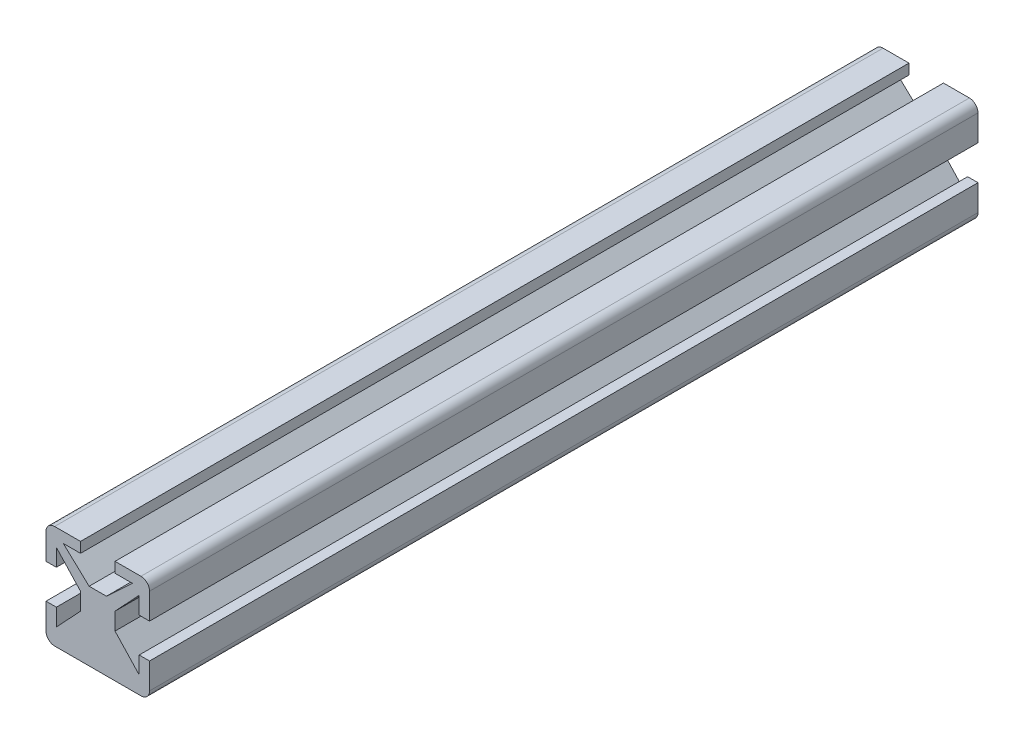
ISO-10303-21;
HEADER;
FILE_DESCRIPTION(('STEP AP214'),'2;1');
FILE_NAME('part.step','',(''),(''),'','','');
FILE_SCHEMA(('AUTOMOTIVE_DESIGN { 1 0 10303 214 1 1 1 1 }'));
ENDSEC;
DATA;
#1=APPLICATION_CONTEXT('core data for automotive mechanical design processes');
#2=APPLICATION_PROTOCOL_DEFINITION('international standard','automotive_design',2000,#1);
#3=PRODUCT_CONTEXT('',#1,'mechanical');
#4=PRODUCT('Part','Part','',(#3));
#5=PRODUCT_RELATED_PRODUCT_CATEGORY('part','',(#4));
#6=PRODUCT_DEFINITION_FORMATION('','',#4);
#7=PRODUCT_DEFINITION_CONTEXT('part definition',#1,'design');
#8=PRODUCT_DEFINITION('design','',#6,#7);
#9=PRODUCT_DEFINITION_SHAPE('','',#8);
#10=(LENGTH_UNIT() NAMED_UNIT(*) SI_UNIT(.MILLI.,.METRE.));
#11=(NAMED_UNIT(*) PLANE_ANGLE_UNIT() SI_UNIT($,.RADIAN.));
#12=(NAMED_UNIT(*) SI_UNIT($,.STERADIAN.) SOLID_ANGLE_UNIT());
#13=UNCERTAINTY_MEASURE_WITH_UNIT(LENGTH_MEASURE(1.E-05),#10,'distance_accuracy_value','');
#14=(GEOMETRIC_REPRESENTATION_CONTEXT(3) GLOBAL_UNCERTAINTY_ASSIGNED_CONTEXT((#13)) GLOBAL_UNIT_ASSIGNED_CONTEXT((#10,
#11,#12)) REPRESENTATION_CONTEXT('',''));
#15=CARTESIAN_POINT('',(0.,0.,0.));
#16=DIRECTION('',(0.,0.,1.));
#17=DIRECTION('',(1.,0.,0.));
#18=AXIS2_PLACEMENT_3D('',#15,#16,#17);
#19=CARTESIAN_POINT('',(-6.,5.,48.));
#20=DIRECTION('',(1.,0.,0.));
#21=DIRECTION('',(0.,1.,0.));
#22=AXIS2_PLACEMENT_3D('',#19,#20,#21);
#23=PLANE('',#22);
#24=DIRECTION('',(0.,-1.,0.));
#25=VECTOR('',#24,1.);
#26=CARTESIAN_POINT('',(-6.,5.,-48.));
#27=LINE('',#26,#25);
#28=CARTESIAN_POINT('',(-6.,5.,-48.));
#29=VERTEX_POINT('',#28);
#30=CARTESIAN_POINT('',(-6.,2.,-48.));
#31=VERTEX_POINT('',#30);
#32=EDGE_CURVE('E265',#29,#31,#27,.T.);
#33=ORIENTED_EDGE('',*,*,#32,.T.);
#34=DIRECTION('',(0.,0.,1.));
#35=VECTOR('',#34,1.);
#36=CARTESIAN_POINT('',(-6.,2.,-48.));
#37=LINE('',#36,#35);
#38=CARTESIAN_POINT('',(-6.,2.,48.));
#39=VERTEX_POINT('',#38);
#40=EDGE_CURVE('E338',#31,#39,#37,.T.);
#41=ORIENTED_EDGE('',*,*,#40,.T.);
#42=DIRECTION('',(0.,-1.,0.));
#43=VECTOR('',#42,1.);
#44=CARTESIAN_POINT('',(-6.,5.,48.));
#45=LINE('',#44,#43);
#46=CARTESIAN_POINT('',(-6.,5.,48.));
#47=VERTEX_POINT('',#46);
#48=EDGE_CURVE('E277',#47,#39,#45,.T.);
#49=ORIENTED_EDGE('',*,*,#48,.F.);
#50=DIRECTION('',(0.,0.,-1.));
#51=VECTOR('',#50,1.);
#52=CARTESIAN_POINT('',(-6.,5.,48.));
#53=LINE('',#52,#51);
#54=EDGE_CURVE('E276',#47,#29,#53,.T.);
#55=ORIENTED_EDGE('',*,*,#54,.T.);
#56=EDGE_LOOP('',(#33,#41,#49,#55));
#57=FACE_BOUND('',#56,.T.);
#58=ADVANCED_FACE('F32',(#57),#23,.F.);
#59=CARTESIAN_POINT('',(-5.,6.,48.));
#60=DIRECTION('',(0.,-1.,0.));
#61=DIRECTION('',(0.,0.,-1.));
#62=AXIS2_PLACEMENT_3D('',#59,#60,#61);
#63=PLANE('',#62);
#64=DIRECTION('',(-1.,0.,0.));
#65=VECTOR('',#64,1.);
#66=CARTESIAN_POINT('',(-5.,6.,-48.));
#67=LINE('',#66,#65);
#68=CARTESIAN_POINT('',(5.,6.,-48.));
#69=VERTEX_POINT('',#68);
#70=CARTESIAN_POINT('',(1.99999999999998,6.00000000000001,-48.));
#71=VERTEX_POINT('',#70);
#72=EDGE_CURVE('E270',#69,#71,#67,.T.);
#73=ORIENTED_EDGE('',*,*,#72,.T.);
#74=DIRECTION('',(0.,0.,1.));
#75=VECTOR('',#74,1.);
#76=CARTESIAN_POINT('',(1.99999999999998,6.00000000000001,-48.));
#77=LINE('',#76,#75);
#78=CARTESIAN_POINT('',(1.99999999999998,6.00000000000001,48.));
#79=VERTEX_POINT('',#78);
#80=EDGE_CURVE('E418',#71,#79,#77,.T.);
#81=ORIENTED_EDGE('',*,*,#80,.T.);
#82=DIRECTION('',(-1.,0.,0.));
#83=VECTOR('',#82,1.);
#84=CARTESIAN_POINT('',(-5.,6.,48.));
#85=LINE('',#84,#83);
#86=CARTESIAN_POINT('',(5.,6.,48.));
#87=VERTEX_POINT('',#86);
#88=EDGE_CURVE('E382',#87,#79,#85,.T.);
#89=ORIENTED_EDGE('',*,*,#88,.F.);
#90=DIRECTION('',(0.,0.,-1.));
#91=VECTOR('',#90,1.);
#92=CARTESIAN_POINT('',(5.,6.,48.));
#93=LINE('',#92,#91);
#94=EDGE_CURVE('E283',#87,#69,#93,.T.);
#95=ORIENTED_EDGE('',*,*,#94,.T.);
#96=EDGE_LOOP('',(#73,#81,#89,#95));
#97=FACE_BOUND('',#96,.T.);
#98=ADVANCED_FACE('F477',(#97),#63,.F.);
#99=CARTESIAN_POINT('',(6.,5.,48.));
#100=DIRECTION('',(-1.,0.,0.));
#101=DIRECTION('',(0.,0.,1.));
#102=AXIS2_PLACEMENT_3D('',#99,#100,#101);
#103=PLANE('',#102);
#104=DIRECTION('',(0.,1.,0.));
#105=VECTOR('',#104,1.);
#106=CARTESIAN_POINT('',(6.,5.,-48.));
#107=LINE('',#106,#105);
#108=CARTESIAN_POINT('',(6.,-5.,-48.));
#109=VERTEX_POINT('',#108);
#110=CARTESIAN_POINT('',(6.,-2.,-48.));
#111=VERTEX_POINT('',#110);
#112=EDGE_CURVE('E305',#109,#111,#107,.T.);
#113=ORIENTED_EDGE('',*,*,#112,.T.);
#114=DIRECTION('',(0.,0.,1.));
#115=VECTOR('',#114,1.);
#116=CARTESIAN_POINT('',(6.,-2.,-48.));
#117=LINE('',#116,#115);
#118=CARTESIAN_POINT('',(6.,-2.,48.));
#119=VERTEX_POINT('',#118);
#120=EDGE_CURVE('E345',#111,#119,#117,.T.);
#121=ORIENTED_EDGE('',*,*,#120,.T.);
#122=DIRECTION('',(0.,1.,0.));
#123=VECTOR('',#122,1.);
#124=CARTESIAN_POINT('',(6.,5.,48.));
#125=LINE('',#124,#123);
#126=CARTESIAN_POINT('',(6.,-5.,48.));
#127=VERTEX_POINT('',#126);
#128=EDGE_CURVE('E378',#127,#119,#125,.T.);
#129=ORIENTED_EDGE('',*,*,#128,.F.);
#130=DIRECTION('',(0.,0.,-1.));
#131=VECTOR('',#130,1.);
#132=CARTESIAN_POINT('',(6.,-5.,48.));
#133=LINE('',#132,#131);
#134=EDGE_CURVE('E289',#127,#109,#133,.T.);
#135=ORIENTED_EDGE('',*,*,#134,.T.);
#136=EDGE_LOOP('',(#113,#121,#129,#135));
#137=FACE_BOUND('',#136,.T.);
#138=ADVANCED_FACE('F475',(#137),#103,.F.);
#139=CARTESIAN_POINT('',(-5.,-5.,48.));
#140=DIRECTION('',(0.,0.,-1.));
#141=DIRECTION('',(-1.,0.,0.));
#142=AXIS2_PLACEMENT_3D('',#139,#140,#141);
#143=CYLINDRICAL_SURFACE('',#142,1.);
#144=CARTESIAN_POINT('',(-5.,-5.,-48.));
#145=DIRECTION('',(0.,0.,1.));
#146=DIRECTION('',(-1.,0.,0.));
#147=AXIS2_PLACEMENT_3D('',#144,#145,#146);
#148=CIRCLE('',#147,1.);
#149=CARTESIAN_POINT('',(-6.,-5.,-48.));
#150=VERTEX_POINT('',#149);
#151=CARTESIAN_POINT('',(-5.,-6.,-48.));
#152=VERTEX_POINT('',#151);
#153=EDGE_CURVE('E264',#150,#152,#148,.T.);
#154=ORIENTED_EDGE('',*,*,#153,.T.);
#155=DIRECTION('',(0.,0.,-1.));
#156=VECTOR('',#155,1.);
#157=CARTESIAN_POINT('',(-5.,-6.,48.));
#158=LINE('',#157,#156);
#159=CARTESIAN_POINT('',(-5.,-6.,48.));
#160=VERTEX_POINT('',#159);
#161=EDGE_CURVE('E11',#160,#152,#158,.T.);
#162=ORIENTED_EDGE('',*,*,#161,.F.);
#163=CARTESIAN_POINT('',(-5.,-5.,48.));
#164=DIRECTION('',(0.,0.,1.));
#165=DIRECTION('',(-1.,0.,0.));
#166=AXIS2_PLACEMENT_3D('',#163,#164,#165);
#167=CIRCLE('',#166,1.);
#168=CARTESIAN_POINT('',(-6.,-5.,48.));
#169=VERTEX_POINT('',#168);
#170=EDGE_CURVE('E269',#169,#160,#167,.T.);
#171=ORIENTED_EDGE('',*,*,#170,.F.);
#172=DIRECTION('',(0.,0.,-1.));
#173=VECTOR('',#172,1.);
#174=CARTESIAN_POINT('',(-6.,-5.,48.));
#175=LINE('',#174,#173);
#176=EDGE_CURVE('E274',#169,#150,#175,.T.);
#177=ORIENTED_EDGE('',*,*,#176,.T.);
#178=EDGE_LOOP('',(#154,#162,#171,#177));
#179=FACE_BOUND('',#178,.T.);
#180=ADVANCED_FACE('F34',(#179),#143,.T.);
#181=CARTESIAN_POINT('',(-5.,-6.,48.));
#182=DIRECTION('',(0.,1.,0.));
#183=DIRECTION('',(-1.,0.,0.));
#184=AXIS2_PLACEMENT_3D('',#181,#182,#183);
#185=PLANE('',#184);
#186=DIRECTION('',(1.,0.,0.));
#187=VECTOR('',#186,1.);
#188=CARTESIAN_POINT('',(-5.,-6.,-48.));
#189=LINE('',#188,#187);
#190=CARTESIAN_POINT('',(5.,-6.,-48.));
#191=VERTEX_POINT('',#190);
#192=EDGE_CURVE('E302',#152,#191,#189,.T.);
#193=ORIENTED_EDGE('',*,*,#192,.T.);
#194=DIRECTION('',(0.,0.,-1.));
#195=VECTOR('',#194,1.);
#196=CARTESIAN_POINT('',(5.,-6.,48.));
#197=LINE('',#196,#195);
#198=CARTESIAN_POINT('',(5.,-6.,48.));
#199=VERTEX_POINT('',#198);
#200=EDGE_CURVE('E40',#199,#191,#197,.T.);
#201=ORIENTED_EDGE('',*,*,#200,.F.);
#202=DIRECTION('',(1.,0.,0.));
#203=VECTOR('',#202,1.);
#204=CARTESIAN_POINT('',(-5.,-6.,48.));
#205=LINE('',#204,#203);
#206=EDGE_CURVE('E374',#160,#199,#205,.T.);
#207=ORIENTED_EDGE('',*,*,#206,.F.);
#208=ORIENTED_EDGE('',*,*,#161,.T.);
#209=EDGE_LOOP('',(#193,#201,#207,#208));
#210=FACE_BOUND('',#209,.T.);
#211=ADVANCED_FACE('F484',(#210),#185,.F.);
#212=CARTESIAN_POINT('',(5.,-5.,48.));
#213=DIRECTION('',(0.,0.,-1.));
#214=DIRECTION('',(-1.,0.,0.));
#215=AXIS2_PLACEMENT_3D('',#212,#213,#214);
#216=CYLINDRICAL_SURFACE('',#215,1.);
#217=CARTESIAN_POINT('',(5.,-5.,-48.));
#218=DIRECTION('',(0.,0.,1.));
#219=DIRECTION('',(-1.,0.,0.));
#220=AXIS2_PLACEMENT_3D('',#217,#218,#219);
#221=CIRCLE('',#220,1.);
#222=EDGE_CURVE('E298',#191,#109,#221,.T.);
#223=ORIENTED_EDGE('',*,*,#222,.T.);
#224=ORIENTED_EDGE('',*,*,#134,.F.);
#225=CARTESIAN_POINT('',(5.,-5.,48.));
#226=DIRECTION('',(0.,0.,1.));
#227=DIRECTION('',(-1.,0.,0.));
#228=AXIS2_PLACEMENT_3D('',#225,#226,#227);
#229=CIRCLE('',#228,1.);
#230=EDGE_CURVE('E299',#199,#127,#229,.T.);
#231=ORIENTED_EDGE('',*,*,#230,.F.);
#232=ORIENTED_EDGE('',*,*,#200,.T.);
#233=EDGE_LOOP('',(#223,#224,#231,#232));
#234=FACE_BOUND('',#233,.T.);
#235=ADVANCED_FACE('F296',(#234),#216,.T.);
#236=CARTESIAN_POINT('',(6.,2.,48.));
#237=VERTEX_POINT('',#236);
#238=CARTESIAN_POINT('',(6.,5.,48.));
#239=VERTEX_POINT('',#238);
#240=EDGE_CURVE('E377',#237,#239,#125,.T.);
#241=ORIENTED_EDGE('',*,*,#240,.F.);
#242=DIRECTION('',(0.,0.,1.));
#243=VECTOR('',#242,1.);
#244=CARTESIAN_POINT('',(6.,2.,-48.));
#245=LINE('',#244,#243);
#246=CARTESIAN_POINT('',(6.,2.,-48.));
#247=VERTEX_POINT('',#246);
#248=EDGE_CURVE('E369',#247,#237,#245,.T.);
#249=ORIENTED_EDGE('',*,*,#248,.F.);
#250=CARTESIAN_POINT('',(6.,5.,-48.));
#251=VERTEX_POINT('',#250);
#252=EDGE_CURVE('E306',#247,#251,#107,.T.);
#253=ORIENTED_EDGE('',*,*,#252,.T.);
#254=DIRECTION('',(0.,0.,-1.));
#255=VECTOR('',#254,1.);
#256=CARTESIAN_POINT('',(6.,5.,48.));
#257=LINE('',#256,#255);
#258=EDGE_CURVE('E286',#239,#251,#257,.T.);
#259=ORIENTED_EDGE('',*,*,#258,.F.);
#260=EDGE_LOOP('',(#241,#249,#253,#259));
#261=FACE_BOUND('',#260,.T.);
#262=ADVANCED_FACE('F479',(#261),#103,.F.);
#263=CARTESIAN_POINT('',(5.,5.,48.));
#264=DIRECTION('',(0.,0.,-1.));
#265=DIRECTION('',(-1.,0.,0.));
#266=AXIS2_PLACEMENT_3D('',#263,#264,#265);
#267=CYLINDRICAL_SURFACE('',#266,1.);
#268=CARTESIAN_POINT('',(5.,5.,-48.));
#269=DIRECTION('',(0.,0.,1.));
#270=DIRECTION('',(-1.,0.,0.));
#271=AXIS2_PLACEMENT_3D('',#268,#269,#270);
#272=CIRCLE('',#271,1.);
#273=EDGE_CURVE('E312',#251,#69,#272,.T.);
#274=ORIENTED_EDGE('',*,*,#273,.T.);
#275=ORIENTED_EDGE('',*,*,#94,.F.);
#276=CARTESIAN_POINT('',(5.,5.,48.));
#277=DIRECTION('',(0.,0.,1.));
#278=DIRECTION('',(-1.,0.,0.));
#279=AXIS2_PLACEMENT_3D('',#276,#277,#278);
#280=CIRCLE('',#279,1.);
#281=EDGE_CURVE('E380',#239,#87,#280,.T.);
#282=ORIENTED_EDGE('',*,*,#281,.F.);
#283=ORIENTED_EDGE('',*,*,#258,.T.);
#284=EDGE_LOOP('',(#274,#275,#282,#283));
#285=FACE_BOUND('',#284,.T.);
#286=ADVANCED_FACE('F489',(#285),#267,.T.);
#287=CARTESIAN_POINT('',(-2.00000000000002,6.,48.));
#288=VERTEX_POINT('',#287);
#289=CARTESIAN_POINT('',(-5.,6.,48.));
#290=VERTEX_POINT('',#289);
#291=EDGE_CURVE('E381',#288,#290,#85,.T.);
#292=ORIENTED_EDGE('',*,*,#291,.F.);
#293=DIRECTION('',(0.,0.,1.));
#294=VECTOR('',#293,1.);
#295=CARTESIAN_POINT('',(-2.00000000000002,6.,-48.));
#296=LINE('',#295,#294);
#297=CARTESIAN_POINT('',(-2.00000000000002,6.,-48.));
#298=VERTEX_POINT('',#297);
#299=EDGE_CURVE('E325',#298,#288,#296,.T.);
#300=ORIENTED_EDGE('',*,*,#299,.F.);
#301=CARTESIAN_POINT('',(-5.,6.,-48.));
#302=VERTEX_POINT('',#301);
#303=EDGE_CURVE('E313',#298,#302,#67,.T.);
#304=ORIENTED_EDGE('',*,*,#303,.T.);
#305=DIRECTION('',(0.,0.,-1.));
#306=VECTOR('',#305,1.);
#307=CARTESIAN_POINT('',(-5.,6.,48.));
#308=LINE('',#307,#306);
#309=EDGE_CURVE('E280',#290,#302,#308,.T.);
#310=ORIENTED_EDGE('',*,*,#309,.F.);
#311=EDGE_LOOP('',(#292,#300,#304,#310));
#312=FACE_BOUND('',#311,.T.);
#313=ADVANCED_FACE('F323',(#312),#63,.F.);
#314=CARTESIAN_POINT('',(-5.,5.,48.));
#315=DIRECTION('',(0.,0.,-1.));
#316=DIRECTION('',(-1.,0.,0.));
#317=AXIS2_PLACEMENT_3D('',#314,#315,#316);
#318=CYLINDRICAL_SURFACE('',#317,1.);
#319=CARTESIAN_POINT('',(-5.,5.,-48.));
#320=DIRECTION('',(0.,0.,1.));
#321=DIRECTION('',(1.,0.,0.));
#322=AXIS2_PLACEMENT_3D('',#319,#320,#321);
#323=CIRCLE('',#322,1.);
#324=EDGE_CURVE('E266',#302,#29,#323,.T.);
#325=ORIENTED_EDGE('',*,*,#324,.T.);
#326=ORIENTED_EDGE('',*,*,#54,.F.);
#327=CARTESIAN_POINT('',(-5.,5.,48.));
#328=DIRECTION('',(0.,0.,1.));
#329=DIRECTION('',(1.,0.,0.));
#330=AXIS2_PLACEMENT_3D('',#327,#328,#329);
#331=CIRCLE('',#330,1.);
#332=EDGE_CURVE('E331',#290,#47,#331,.T.);
#333=ORIENTED_EDGE('',*,*,#332,.F.);
#334=ORIENTED_EDGE('',*,*,#309,.T.);
#335=EDGE_LOOP('',(#325,#326,#333,#334));
#336=FACE_BOUND('',#335,.T.);
#337=ADVANCED_FACE('F329',(#336),#318,.T.);
#338=CARTESIAN_POINT('',(-6.,-2.,48.));
#339=VERTEX_POINT('',#338);
#340=EDGE_CURVE('E257',#339,#169,#45,.T.);
#341=ORIENTED_EDGE('',*,*,#340,.F.);
#342=DIRECTION('',(0.,0.,1.));
#343=VECTOR('',#342,1.);
#344=CARTESIAN_POINT('',(-6.,-2.,-48.));
#345=LINE('',#344,#343);
#346=CARTESIAN_POINT('',(-6.,-2.,-48.));
#347=VERTEX_POINT('',#346);
#348=EDGE_CURVE('E244',#347,#339,#345,.T.);
#349=ORIENTED_EDGE('',*,*,#348,.F.);
#350=EDGE_CURVE('E255',#347,#150,#27,.T.);
#351=ORIENTED_EDGE('',*,*,#350,.T.);
#352=ORIENTED_EDGE('',*,*,#176,.F.);
#353=EDGE_LOOP('',(#341,#349,#351,#352));
#354=FACE_BOUND('',#353,.T.);
#355=ADVANCED_FACE('F253',(#354),#23,.F.);
#356=CARTESIAN_POINT('',(-5.,-5.,48.));
#357=DIRECTION('',(0.,0.,-1.));
#358=DIRECTION('',(-1.,0.,0.));
#359=AXIS2_PLACEMENT_3D('',#356,#357,#358);
#360=PLANE('',#359);
#361=ORIENTED_EDGE('',*,*,#48,.T.);
#362=DIRECTION('',(-1.,0.,0.));
#363=VECTOR('',#362,1.);
#364=CARTESIAN_POINT('',(-4.8,2.,48.));
#365=LINE('',#364,#363);
#366=CARTESIAN_POINT('',(-4.8,2.,48.));
#367=VERTEX_POINT('',#366);
#368=EDGE_CURVE('E249',#367,#39,#365,.T.);
#369=ORIENTED_EDGE('',*,*,#368,.F.);
#370=DIRECTION('',(0.,-1.,0.));
#371=VECTOR('',#370,1.);
#372=CARTESIAN_POINT('',(-4.8,4.,48.));
#373=LINE('',#372,#371);
#374=CARTESIAN_POINT('',(-4.8,4.,48.));
#375=VERTEX_POINT('',#374);
#376=EDGE_CURVE('E544',#375,#367,#373,.T.);
#377=ORIENTED_EDGE('',*,*,#376,.F.);
#378=DIRECTION('',(-0.682318250360011,0.731055268242869,0.));
#379=VECTOR('',#378,1.);
#380=CARTESIAN_POINT('',(-4.8,4.,48.));
#381=LINE('',#380,#379);
#382=CARTESIAN_POINT('',(-2.,1.,48.));
#383=VERTEX_POINT('',#382);
#384=EDGE_CURVE('E547',#383,#375,#381,.T.);
#385=ORIENTED_EDGE('',*,*,#384,.F.);
#386=DIRECTION('',(0.,1.,0.));
#387=VECTOR('',#386,1.);
#388=CARTESIAN_POINT('',(-2.,-1.,48.));
#389=LINE('',#388,#387);
#390=CARTESIAN_POINT('',(-2.,-1.,48.));
#391=VERTEX_POINT('',#390);
#392=EDGE_CURVE('E550',#391,#383,#389,.T.);
#393=ORIENTED_EDGE('',*,*,#392,.F.);
#394=DIRECTION('',(0.682318250360011,0.731055268242869,0.));
#395=VECTOR('',#394,1.);
#396=CARTESIAN_POINT('',(-4.8,-4.,48.));
#397=LINE('',#396,#395);
#398=CARTESIAN_POINT('',(-4.8,-4.,48.));
#399=VERTEX_POINT('',#398);
#400=EDGE_CURVE('E553',#399,#391,#397,.T.);
#401=ORIENTED_EDGE('',*,*,#400,.F.);
#402=DIRECTION('',(0.,-1.,0.));
#403=VECTOR('',#402,1.);
#404=CARTESIAN_POINT('',(-4.8,-2.,48.));
#405=LINE('',#404,#403);
#406=CARTESIAN_POINT('',(-4.8,-2.,48.));
#407=VERTEX_POINT('',#406);
#408=EDGE_CURVE('E556',#407,#399,#405,.T.);
#409=ORIENTED_EDGE('',*,*,#408,.F.);
#410=DIRECTION('',(1.,0.,0.));
#411=VECTOR('',#410,1.);
#412=CARTESIAN_POINT('',(-6.,-2.,48.));
#413=LINE('',#412,#411);
#414=EDGE_CURVE('E559',#339,#407,#413,.T.);
#415=ORIENTED_EDGE('',*,*,#414,.F.);
#416=ORIENTED_EDGE('',*,*,#340,.T.);
#417=ORIENTED_EDGE('',*,*,#170,.T.);
#418=ORIENTED_EDGE('',*,*,#206,.T.);
#419=ORIENTED_EDGE('',*,*,#230,.T.);
#420=ORIENTED_EDGE('',*,*,#128,.T.);
#421=DIRECTION('',(1.,0.,0.));
#422=VECTOR('',#421,1.);
#423=CARTESIAN_POINT('',(4.8,-2.,48.));
#424=LINE('',#423,#422);
#425=CARTESIAN_POINT('',(4.8,-2.,48.));
#426=VERTEX_POINT('',#425);
#427=EDGE_CURVE('E357',#426,#119,#424,.T.);
#428=ORIENTED_EDGE('',*,*,#427,.F.);
#429=DIRECTION('',(0.,1.,0.));
#430=VECTOR('',#429,1.);
#431=CARTESIAN_POINT('',(4.8,-4.,48.));
#432=LINE('',#431,#430);
#433=CARTESIAN_POINT('',(4.8,-4.,48.));
#434=VERTEX_POINT('',#433);
#435=EDGE_CURVE('E466',#434,#426,#432,.T.);
#436=ORIENTED_EDGE('',*,*,#435,.F.);
#437=DIRECTION('',(0.682318250360011,-0.731055268242869,0.));
#438=VECTOR('',#437,1.);
#439=CARTESIAN_POINT('',(4.8,-4.,48.));
#440=LINE('',#439,#438);
#441=CARTESIAN_POINT('',(2.,-1.,48.));
#442=VERTEX_POINT('',#441);
#443=EDGE_CURVE('E464',#442,#434,#440,.T.);
#444=ORIENTED_EDGE('',*,*,#443,.F.);
#445=DIRECTION('',(0.,-1.,0.));
#446=VECTOR('',#445,1.);
#447=CARTESIAN_POINT('',(2.,1.,48.));
#448=LINE('',#447,#446);
#449=CARTESIAN_POINT('',(2.,1.,48.));
#450=VERTEX_POINT('',#449);
#451=EDGE_CURVE('E461',#450,#442,#448,.T.);
#452=ORIENTED_EDGE('',*,*,#451,.F.);
#453=DIRECTION('',(-0.682318250360011,-0.731055268242869,0.));
#454=VECTOR('',#453,1.);
#455=CARTESIAN_POINT('',(4.8,4.,48.));
#456=LINE('',#455,#454);
#457=CARTESIAN_POINT('',(4.8,4.,48.));
#458=VERTEX_POINT('',#457);
#459=EDGE_CURVE('E458',#458,#450,#456,.T.);
#460=ORIENTED_EDGE('',*,*,#459,.F.);
#461=DIRECTION('',(0.,1.,0.));
#462=VECTOR('',#461,1.);
#463=CARTESIAN_POINT('',(4.8,2.,48.));
#464=LINE('',#463,#462);
#465=CARTESIAN_POINT('',(4.8,2.,48.));
#466=VERTEX_POINT('',#465);
#467=EDGE_CURVE('E455',#466,#458,#464,.T.);
#468=ORIENTED_EDGE('',*,*,#467,.F.);
#469=DIRECTION('',(-1.,0.,0.));
#470=VECTOR('',#469,1.);
#471=CARTESIAN_POINT('',(6.,2.,48.));
#472=LINE('',#471,#470);
#473=EDGE_CURVE('E420',#237,#466,#472,.T.);
#474=ORIENTED_EDGE('',*,*,#473,.F.);
#475=ORIENTED_EDGE('',*,*,#240,.T.);
#476=ORIENTED_EDGE('',*,*,#281,.T.);
#477=ORIENTED_EDGE('',*,*,#88,.T.);
#478=DIRECTION('',(0.,1.,0.));
#479=VECTOR('',#478,1.);
#480=CARTESIAN_POINT('',(1.99999999999998,4.80000000000001,48.));
#481=LINE('',#480,#479);
#482=CARTESIAN_POINT('',(1.99999999999998,4.80000000000001,48.));
#483=VERTEX_POINT('',#482);
#484=EDGE_CURVE('E415',#483,#79,#481,.T.);
#485=ORIENTED_EDGE('',*,*,#484,.F.);
#486=DIRECTION('',(-1.,0.,0.));
#487=VECTOR('',#486,1.);
#488=CARTESIAN_POINT('',(3.99999999999998,4.80000000000002,48.));
#489=LINE('',#488,#487);
#490=CARTESIAN_POINT('',(3.99999999999998,4.80000000000002,48.));
#491=VERTEX_POINT('',#490);
#492=EDGE_CURVE('E412',#491,#483,#489,.T.);
#493=ORIENTED_EDGE('',*,*,#492,.F.);
#494=DIRECTION('',(0.731055268242867,0.682318250360014,0.));
#495=VECTOR('',#494,1.);
#496=CARTESIAN_POINT('',(3.99999999999998,4.80000000000002,48.));
#497=LINE('',#496,#495);
#498=CARTESIAN_POINT('',(0.999999999999993,2.,48.));
#499=VERTEX_POINT('',#498);
#500=EDGE_CURVE('E409',#499,#491,#497,.T.);
#501=ORIENTED_EDGE('',*,*,#500,.F.);
#502=DIRECTION('',(1.,0.,0.));
#503=VECTOR('',#502,1.);
#504=CARTESIAN_POINT('',(-1.00000000000001,2.,48.));
#505=LINE('',#504,#503);
#506=CARTESIAN_POINT('',(-1.00000000000001,2.,48.));
#507=VERTEX_POINT('',#506);
#508=EDGE_CURVE('E406',#507,#499,#505,.T.);
#509=ORIENTED_EDGE('',*,*,#508,.F.);
#510=DIRECTION('',(0.731055268242871,-0.682318250360009,0.));
#511=VECTOR('',#510,1.);
#512=CARTESIAN_POINT('',(-4.00000000000002,4.79999999999999,48.));
#513=LINE('',#512,#511);
#514=CARTESIAN_POINT('',(-4.00000000000002,4.79999999999999,48.));
#515=VERTEX_POINT('',#514);
#516=EDGE_CURVE('E396',#515,#507,#513,.T.);
#517=ORIENTED_EDGE('',*,*,#516,.F.);
#518=DIRECTION('',(-1.,0.,0.));
#519=VECTOR('',#518,1.);
#520=CARTESIAN_POINT('',(-2.00000000000002,4.8,48.));
#521=LINE('',#520,#519);
#522=CARTESIAN_POINT('',(-2.00000000000002,4.8,48.));
#523=VERTEX_POINT('',#522);
#524=EDGE_CURVE('E393',#523,#515,#521,.T.);
#525=ORIENTED_EDGE('',*,*,#524,.F.);
#526=DIRECTION('',(0.,-1.,0.));
#527=VECTOR('',#526,1.);
#528=CARTESIAN_POINT('',(-2.00000000000002,6.,48.));
#529=LINE('',#528,#527);
#530=EDGE_CURVE('E390',#288,#523,#529,.T.);
#531=ORIENTED_EDGE('',*,*,#530,.F.);
#532=ORIENTED_EDGE('',*,*,#291,.T.);
#533=ORIENTED_EDGE('',*,*,#332,.T.);
#534=EDGE_LOOP('',(#361,#369,#377,#385,#393,#401,#409,#415,#416,#417,#418,#419,#420,#428,#436,
#444,#452,#460,#468,#474,#475,#476,#477,#485,#493,#501,#509,#517,#525,#531,#532,#533));
#535=FACE_BOUND('',#534,.T.);
#536=ADVANCED_FACE('F387',(#535),#360,.F.);
#537=CARTESIAN_POINT('',(-5.,-5.,-48.));
#538=DIRECTION('',(0.,0.,-1.));
#539=DIRECTION('',(-1.,0.,0.));
#540=AXIS2_PLACEMENT_3D('',#537,#538,#539);
#541=PLANE('',#540);
#542=DIRECTION('',(-1.,0.,0.));
#543=VECTOR('',#542,1.);
#544=CARTESIAN_POINT('',(-4.8,2.,-48.));
#545=LINE('',#544,#543);
#546=CARTESIAN_POINT('',(-4.8,2.,-48.));
#547=VERTEX_POINT('',#546);
#548=EDGE_CURVE('E258',#547,#31,#545,.T.);
#549=ORIENTED_EDGE('',*,*,#548,.T.);
#550=ORIENTED_EDGE('',*,*,#32,.F.);
#551=ORIENTED_EDGE('',*,*,#324,.F.);
#552=ORIENTED_EDGE('',*,*,#303,.F.);
#553=DIRECTION('',(0.,-1.,0.));
#554=VECTOR('',#553,1.);
#555=CARTESIAN_POINT('',(-2.00000000000002,6.,-48.));
#556=LINE('',#555,#554);
#557=CARTESIAN_POINT('',(-2.00000000000002,4.8,-48.));
#558=VERTEX_POINT('',#557);
#559=EDGE_CURVE('E417',#298,#558,#556,.T.);
#560=ORIENTED_EDGE('',*,*,#559,.T.);
#561=DIRECTION('',(-1.,0.,0.));
#562=VECTOR('',#561,1.);
#563=CARTESIAN_POINT('',(-2.00000000000002,4.8,-48.));
#564=LINE('',#563,#562);
#565=CARTESIAN_POINT('',(-4.00000000000002,4.79999999999999,-48.));
#566=VERTEX_POINT('',#565);
#567=EDGE_CURVE('E55',#558,#566,#564,.T.);
#568=ORIENTED_EDGE('',*,*,#567,.T.);
#569=DIRECTION('',(0.731055268242871,-0.682318250360009,0.));
#570=VECTOR('',#569,1.);
#571=CARTESIAN_POINT('',(-4.00000000000002,4.79999999999999,-48.));
#572=LINE('',#571,#570);
#573=CARTESIAN_POINT('',(-1.00000000000001,2.,-48.));
#574=VERTEX_POINT('',#573);
#575=EDGE_CURVE('E528',#566,#574,#572,.T.);
#576=ORIENTED_EDGE('',*,*,#575,.T.);
#577=DIRECTION('',(1.,0.,0.));
#578=VECTOR('',#577,1.);
#579=CARTESIAN_POINT('',(-1.00000000000001,2.,-48.));
#580=LINE('',#579,#578);
#581=CARTESIAN_POINT('',(0.999999999999993,2.,-48.));
#582=VERTEX_POINT('',#581);
#583=EDGE_CURVE('E523',#574,#582,#580,.T.);
#584=ORIENTED_EDGE('',*,*,#583,.T.);
#585=DIRECTION('',(0.731055268242867,0.682318250360014,0.));
#586=VECTOR('',#585,1.);
#587=CARTESIAN_POINT('',(3.99999999999998,4.80000000000002,-48.));
#588=LINE('',#587,#586);
#589=CARTESIAN_POINT('',(3.99999999999998,4.80000000000002,-48.));
#590=VERTEX_POINT('',#589);
#591=EDGE_CURVE('E522',#582,#590,#588,.T.);
#592=ORIENTED_EDGE('',*,*,#591,.T.);
#593=DIRECTION('',(-1.,0.,0.));
#594=VECTOR('',#593,1.);
#595=CARTESIAN_POINT('',(3.99999999999998,4.80000000000002,-48.));
#596=LINE('',#595,#594);
#597=CARTESIAN_POINT('',(1.99999999999998,4.80000000000001,-48.));
#598=VERTEX_POINT('',#597);
#599=EDGE_CURVE('E520',#590,#598,#596,.T.);
#600=ORIENTED_EDGE('',*,*,#599,.T.);
#601=DIRECTION('',(0.,1.,0.));
#602=VECTOR('',#601,1.);
#603=CARTESIAN_POINT('',(1.99999999999998,4.80000000000001,-48.));
#604=LINE('',#603,#602);
#605=EDGE_CURVE('E401',#598,#71,#604,.T.);
#606=ORIENTED_EDGE('',*,*,#605,.T.);
#607=ORIENTED_EDGE('',*,*,#72,.F.);
#608=ORIENTED_EDGE('',*,*,#273,.F.);
#609=ORIENTED_EDGE('',*,*,#252,.F.);
#610=DIRECTION('',(-1.,0.,0.));
#611=VECTOR('',#610,1.);
#612=CARTESIAN_POINT('',(6.,2.,-48.));
#613=LINE('',#612,#611);
#614=CARTESIAN_POINT('',(4.8,2.,-48.));
#615=VERTEX_POINT('',#614);
#616=EDGE_CURVE('E434',#247,#615,#613,.T.);
#617=ORIENTED_EDGE('',*,*,#616,.T.);
#618=DIRECTION('',(0.,1.,0.));
#619=VECTOR('',#618,1.);
#620=CARTESIAN_POINT('',(4.8,2.,-48.));
#621=LINE('',#620,#619);
#622=CARTESIAN_POINT('',(4.8,4.,-48.));
#623=VERTEX_POINT('',#622);
#624=EDGE_CURVE('E437',#615,#623,#621,.T.);
#625=ORIENTED_EDGE('',*,*,#624,.T.);
#626=DIRECTION('',(-0.682318250360011,-0.731055268242869,0.));
#627=VECTOR('',#626,1.);
#628=CARTESIAN_POINT('',(4.8,4.,-48.));
#629=LINE('',#628,#627);
#630=CARTESIAN_POINT('',(2.,1.,-48.));
#631=VERTEX_POINT('',#630);
#632=EDGE_CURVE('E440',#623,#631,#629,.T.);
#633=ORIENTED_EDGE('',*,*,#632,.T.);
#634=DIRECTION('',(0.,-1.,0.));
#635=VECTOR('',#634,1.);
#636=CARTESIAN_POINT('',(2.,1.,-48.));
#637=LINE('',#636,#635);
#638=CARTESIAN_POINT('',(2.,-1.,-48.));
#639=VERTEX_POINT('',#638);
#640=EDGE_CURVE('E443',#631,#639,#637,.T.);
#641=ORIENTED_EDGE('',*,*,#640,.T.);
#642=DIRECTION('',(0.682318250360011,-0.731055268242869,0.));
#643=VECTOR('',#642,1.);
#644=CARTESIAN_POINT('',(4.8,-4.,-48.));
#645=LINE('',#644,#643);
#646=CARTESIAN_POINT('',(4.8,-4.,-48.));
#647=VERTEX_POINT('',#646);
#648=EDGE_CURVE('E446',#639,#647,#645,.T.);
#649=ORIENTED_EDGE('',*,*,#648,.T.);
#650=DIRECTION('',(0.,1.,0.));
#651=VECTOR('',#650,1.);
#652=CARTESIAN_POINT('',(4.8,-4.,-48.));
#653=LINE('',#652,#651);
#654=CARTESIAN_POINT('',(4.8,-2.,-48.));
#655=VERTEX_POINT('',#654);
#656=EDGE_CURVE('E449',#647,#655,#653,.T.);
#657=ORIENTED_EDGE('',*,*,#656,.T.);
#658=DIRECTION('',(1.,0.,0.));
#659=VECTOR('',#658,1.);
#660=CARTESIAN_POINT('',(4.8,-2.,-48.));
#661=LINE('',#660,#659);
#662=EDGE_CURVE('E371',#655,#111,#661,.T.);
#663=ORIENTED_EDGE('',*,*,#662,.T.);
#664=ORIENTED_EDGE('',*,*,#112,.F.);
#665=ORIENTED_EDGE('',*,*,#222,.F.);
#666=ORIENTED_EDGE('',*,*,#192,.F.);
#667=ORIENTED_EDGE('',*,*,#153,.F.);
#668=ORIENTED_EDGE('',*,*,#350,.F.);
#669=DIRECTION('',(1.,0.,0.));
#670=VECTOR('',#669,1.);
#671=CARTESIAN_POINT('',(-6.,-2.,-48.));
#672=LINE('',#671,#670);
#673=CARTESIAN_POINT('',(-4.8,-2.,-48.));
#674=VERTEX_POINT('',#673);
#675=EDGE_CURVE('E240',#347,#674,#672,.T.);
#676=ORIENTED_EDGE('',*,*,#675,.T.);
#677=DIRECTION('',(0.,-1.,0.));
#678=VECTOR('',#677,1.);
#679=CARTESIAN_POINT('',(-4.8,-2.,-48.));
#680=LINE('',#679,#678);
#681=CARTESIAN_POINT('',(-4.8,-4.,-48.));
#682=VERTEX_POINT('',#681);
#683=EDGE_CURVE('E47',#674,#682,#680,.T.);
#684=ORIENTED_EDGE('',*,*,#683,.T.);
#685=DIRECTION('',(0.682318250360011,0.731055268242869,0.));
#686=VECTOR('',#685,1.);
#687=CARTESIAN_POINT('',(-4.8,-4.,-48.));
#688=LINE('',#687,#686);
#689=CARTESIAN_POINT('',(-2.,-1.,-48.));
#690=VERTEX_POINT('',#689);
#691=EDGE_CURVE('E570',#682,#690,#688,.T.);
#692=ORIENTED_EDGE('',*,*,#691,.T.);
#693=DIRECTION('',(0.,1.,0.));
#694=VECTOR('',#693,1.);
#695=CARTESIAN_POINT('',(-2.,-1.,-48.));
#696=LINE('',#695,#694);
#697=CARTESIAN_POINT('',(-2.,1.,-48.));
#698=VERTEX_POINT('',#697);
#699=EDGE_CURVE('E567',#690,#698,#696,.T.);
#700=ORIENTED_EDGE('',*,*,#699,.T.);
#701=DIRECTION('',(-0.682318250360011,0.731055268242869,0.));
#702=VECTOR('',#701,1.);
#703=CARTESIAN_POINT('',(-4.8,4.,-48.));
#704=LINE('',#703,#702);
#705=CARTESIAN_POINT('',(-4.8,4.,-48.));
#706=VERTEX_POINT('',#705);
#707=EDGE_CURVE('E564',#698,#706,#704,.T.);
#708=ORIENTED_EDGE('',*,*,#707,.T.);
#709=DIRECTION('',(0.,-1.,0.));
#710=VECTOR('',#709,1.);
#711=CARTESIAN_POINT('',(-4.8,4.,-48.));
#712=LINE('',#711,#710);
#713=EDGE_CURVE('E562',#706,#547,#712,.T.);
#714=ORIENTED_EDGE('',*,*,#713,.T.);
#715=EDGE_LOOP('',(#549,#550,#551,#552,#560,#568,#576,#584,#592,#600,#606,#607,#608,#609,#617,
#625,#633,#641,#649,#657,#663,#664,#665,#666,#667,#668,#676,#684,#692,#700,#708,#714));
#716=FACE_BOUND('',#715,.T.);
#717=ADVANCED_FACE('F262',(#716),#541,.T.);
#718=CARTESIAN_POINT('',(4.8,-2.,-48.));
#719=DIRECTION('',(0.,-1.,0.));
#720=DIRECTION('',(0.,0.,-1.));
#721=AXIS2_PLACEMENT_3D('',#718,#719,#720);
#722=PLANE('',#721);
#723=ORIENTED_EDGE('',*,*,#427,.T.);
#724=ORIENTED_EDGE('',*,*,#120,.F.);
#725=ORIENTED_EDGE('',*,*,#662,.F.);
#726=DIRECTION('',(0.,0.,1.));
#727=VECTOR('',#726,1.);
#728=CARTESIAN_POINT('',(4.8,-2.,-48.));
#729=LINE('',#728,#727);
#730=EDGE_CURVE('E349',#655,#426,#729,.T.);
#731=ORIENTED_EDGE('',*,*,#730,.T.);
#732=EDGE_LOOP('',(#723,#724,#725,#731));
#733=FACE_BOUND('',#732,.T.);
#734=ADVANCED_FACE('F472',(#733),#722,.F.);
#735=CARTESIAN_POINT('',(4.8,-4.,-48.));
#736=DIRECTION('',(1.,0.,0.));
#737=DIRECTION('',(0.,0.,-1.));
#738=AXIS2_PLACEMENT_3D('',#735,#736,#737);
#739=PLANE('',#738);
#740=ORIENTED_EDGE('',*,*,#435,.T.);
#741=ORIENTED_EDGE('',*,*,#730,.F.);
#742=ORIENTED_EDGE('',*,*,#656,.F.);
#743=DIRECTION('',(0.,0.,1.));
#744=VECTOR('',#743,1.);
#745=CARTESIAN_POINT('',(4.8,-4.,-48.));
#746=LINE('',#745,#744);
#747=EDGE_CURVE('E354',#647,#434,#746,.T.);
#748=ORIENTED_EDGE('',*,*,#747,.T.);
#749=EDGE_LOOP('',(#740,#741,#742,#748));
#750=FACE_BOUND('',#749,.T.);
#751=ADVANCED_FACE('F631',(#750),#739,.F.);
#752=CARTESIAN_POINT('',(4.8,-4.,-48.));
#753=DIRECTION('',(-0.731055268242869,-0.682318250360011,0.));
#754=DIRECTION('',(0.682318250360011,-0.731055268242869,0.));
#755=AXIS2_PLACEMENT_3D('',#752,#753,#754);
#756=PLANE('',#755);
#757=ORIENTED_EDGE('',*,*,#443,.T.);
#758=ORIENTED_EDGE('',*,*,#747,.F.);
#759=ORIENTED_EDGE('',*,*,#648,.F.);
#760=DIRECTION('',(0.,0.,1.));
#761=VECTOR('',#760,1.);
#762=CARTESIAN_POINT('',(2.,-1.,-48.));
#763=LINE('',#762,#761);
#764=EDGE_CURVE('E361',#639,#442,#763,.T.);
#765=ORIENTED_EDGE('',*,*,#764,.T.);
#766=EDGE_LOOP('',(#757,#758,#759,#765));
#767=FACE_BOUND('',#766,.T.);
#768=ADVANCED_FACE('F634',(#767),#756,.F.);
#769=CARTESIAN_POINT('',(2.,1.,-48.));
#770=DIRECTION('',(-1.,0.,0.));
#771=DIRECTION('',(0.,0.,1.));
#772=AXIS2_PLACEMENT_3D('',#769,#770,#771);
#773=PLANE('',#772);
#774=ORIENTED_EDGE('',*,*,#451,.T.);
#775=ORIENTED_EDGE('',*,*,#764,.F.);
#776=ORIENTED_EDGE('',*,*,#640,.F.);
#777=DIRECTION('',(0.,0.,1.));
#778=VECTOR('',#777,1.);
#779=CARTESIAN_POINT('',(2.,1.,-48.));
#780=LINE('',#779,#778);
#781=EDGE_CURVE('E363',#631,#450,#780,.T.);
#782=ORIENTED_EDGE('',*,*,#781,.T.);
#783=EDGE_LOOP('',(#774,#775,#776,#782));
#784=FACE_BOUND('',#783,.T.);
#785=ADVANCED_FACE('F637',(#784),#773,.F.);
#786=CARTESIAN_POINT('',(4.8,4.,-48.));
#787=DIRECTION('',(-0.731055268242869,0.682318250360011,0.));
#788=DIRECTION('',(-0.682318250360011,-0.731055268242869,0.));
#789=AXIS2_PLACEMENT_3D('',#786,#787,#788);
#790=PLANE('',#789);
#791=ORIENTED_EDGE('',*,*,#459,.T.);
#792=ORIENTED_EDGE('',*,*,#781,.F.);
#793=ORIENTED_EDGE('',*,*,#632,.F.);
#794=DIRECTION('',(0.,0.,1.));
#795=VECTOR('',#794,1.);
#796=CARTESIAN_POINT('',(4.8,4.,-48.));
#797=LINE('',#796,#795);
#798=EDGE_CURVE('E365',#623,#458,#797,.T.);
#799=ORIENTED_EDGE('',*,*,#798,.T.);
#800=EDGE_LOOP('',(#791,#792,#793,#799));
#801=FACE_BOUND('',#800,.T.);
#802=ADVANCED_FACE('F641',(#801),#790,.F.);
#803=CARTESIAN_POINT('',(4.8,2.,-48.));
#804=DIRECTION('',(1.,0.,0.));
#805=DIRECTION('',(0.,0.,-1.));
#806=AXIS2_PLACEMENT_3D('',#803,#804,#805);
#807=PLANE('',#806);
#808=ORIENTED_EDGE('',*,*,#467,.T.);
#809=ORIENTED_EDGE('',*,*,#798,.F.);
#810=ORIENTED_EDGE('',*,*,#624,.F.);
#811=DIRECTION('',(0.,0.,1.));
#812=VECTOR('',#811,1.);
#813=CARTESIAN_POINT('',(4.8,2.,-48.));
#814=LINE('',#813,#812);
#815=EDGE_CURVE('E367',#615,#466,#814,.T.);
#816=ORIENTED_EDGE('',*,*,#815,.T.);
#817=EDGE_LOOP('',(#808,#809,#810,#816));
#818=FACE_BOUND('',#817,.T.);
#819=ADVANCED_FACE('F645',(#818),#807,.F.);
#820=CARTESIAN_POINT('',(6.,2.,-48.));
#821=DIRECTION('',(0.,1.,0.));
#822=DIRECTION('',(0.,0.,1.));
#823=AXIS2_PLACEMENT_3D('',#820,#821,#822);
#824=PLANE('',#823);
#825=ORIENTED_EDGE('',*,*,#473,.T.);
#826=ORIENTED_EDGE('',*,*,#815,.F.);
#827=ORIENTED_EDGE('',*,*,#616,.F.);
#828=ORIENTED_EDGE('',*,*,#248,.T.);
#829=EDGE_LOOP('',(#825,#826,#827,#828));
#830=FACE_BOUND('',#829,.T.);
#831=ADVANCED_FACE('F607',(#830),#824,.F.);
#832=CARTESIAN_POINT('',(1.99999999999998,4.80000000000001,-48.));
#833=DIRECTION('',(1.,0.,0.));
#834=DIRECTION('',(0.,1.,0.));
#835=AXIS2_PLACEMENT_3D('',#832,#833,#834);
#836=PLANE('',#835);
#837=ORIENTED_EDGE('',*,*,#484,.T.);
#838=ORIENTED_EDGE('',*,*,#80,.F.);
#839=ORIENTED_EDGE('',*,*,#605,.F.);
#840=DIRECTION('',(0.,0.,1.));
#841=VECTOR('',#840,1.);
#842=CARTESIAN_POINT('',(1.99999999999998,4.80000000000001,-48.));
#843=LINE('',#842,#841);
#844=EDGE_CURVE('E421',#598,#483,#843,.T.);
#845=ORIENTED_EDGE('',*,*,#844,.T.);
#846=EDGE_LOOP('',(#837,#838,#839,#845));
#847=FACE_BOUND('',#846,.T.);
#848=ADVANCED_FACE('F603',(#847),#836,.F.);
#849=CARTESIAN_POINT('',(3.99999999999998,4.80000000000002,-48.));
#850=DIRECTION('',(0.,1.,0.));
#851=DIRECTION('',(-1.,0.,0.));
#852=AXIS2_PLACEMENT_3D('',#849,#850,#851);
#853=PLANE('',#852);
#854=ORIENTED_EDGE('',*,*,#492,.T.);
#855=ORIENTED_EDGE('',*,*,#844,.F.);
#856=ORIENTED_EDGE('',*,*,#599,.F.);
#857=DIRECTION('',(0.,0.,1.));
#858=VECTOR('',#857,1.);
#859=CARTESIAN_POINT('',(3.99999999999998,4.80000000000002,-48.));
#860=LINE('',#859,#858);
#861=EDGE_CURVE('E423',#590,#491,#860,.T.);
#862=ORIENTED_EDGE('',*,*,#861,.T.);
#863=EDGE_LOOP('',(#854,#855,#856,#862));
#864=FACE_BOUND('',#863,.T.);
#865=ADVANCED_FACE('F606',(#864),#853,.F.);
#866=CARTESIAN_POINT('',(3.99999999999998,4.80000000000002,-48.));
#867=DIRECTION('',(0.682318250360014,-0.731055268242866,0.));
#868=DIRECTION('',(0.731055268242866,0.682318250360014,0.));
#869=AXIS2_PLACEMENT_3D('',#866,#867,#868);
#870=PLANE('',#869);
#871=ORIENTED_EDGE('',*,*,#500,.T.);
#872=ORIENTED_EDGE('',*,*,#861,.F.);
#873=ORIENTED_EDGE('',*,*,#591,.F.);
#874=DIRECTION('',(0.,0.,1.));
#875=VECTOR('',#874,1.);
#876=CARTESIAN_POINT('',(0.999999999999993,2.,-48.));
#877=LINE('',#876,#875);
#878=EDGE_CURVE('E425',#582,#499,#877,.T.);
#879=ORIENTED_EDGE('',*,*,#878,.T.);
#880=EDGE_LOOP('',(#871,#872,#873,#879));
#881=FACE_BOUND('',#880,.T.);
#882=ADVANCED_FACE('F610',(#881),#870,.F.);
#883=CARTESIAN_POINT('',(-1.00000000000001,2.,-48.));
#884=DIRECTION('',(0.,-1.,0.));
#885=DIRECTION('',(1.,0.,0.));
#886=AXIS2_PLACEMENT_3D('',#883,#884,#885);
#887=PLANE('',#886);
#888=ORIENTED_EDGE('',*,*,#508,.T.);
#889=ORIENTED_EDGE('',*,*,#878,.F.);
#890=ORIENTED_EDGE('',*,*,#583,.F.);
#891=DIRECTION('',(0.,0.,1.));
#892=VECTOR('',#891,1.);
#893=CARTESIAN_POINT('',(-1.00000000000001,2.,-48.));
#894=LINE('',#893,#892);
#895=EDGE_CURVE('E427',#574,#507,#894,.T.);
#896=ORIENTED_EDGE('',*,*,#895,.T.);
#897=EDGE_LOOP('',(#888,#889,#890,#896));
#898=FACE_BOUND('',#897,.T.);
#899=ADVANCED_FACE('F614',(#898),#887,.F.);
#900=CARTESIAN_POINT('',(-4.00000000000002,4.79999999999999,-48.));
#901=DIRECTION('',(-0.682318250360009,-0.731055268242871,0.));
#902=DIRECTION('',(0.731055268242871,-0.682318250360009,0.));
#903=AXIS2_PLACEMENT_3D('',#900,#901,#902);
#904=PLANE('',#903);
#905=ORIENTED_EDGE('',*,*,#516,.T.);
#906=ORIENTED_EDGE('',*,*,#895,.F.);
#907=ORIENTED_EDGE('',*,*,#575,.F.);
#908=DIRECTION('',(0.,0.,1.));
#909=VECTOR('',#908,1.);
#910=CARTESIAN_POINT('',(-4.00000000000002,4.79999999999999,-48.));
#911=LINE('',#910,#909);
#912=EDGE_CURVE('E429',#566,#515,#911,.T.);
#913=ORIENTED_EDGE('',*,*,#912,.T.);
#914=EDGE_LOOP('',(#905,#906,#907,#913));
#915=FACE_BOUND('',#914,.T.);
#916=ADVANCED_FACE('F618',(#915),#904,.F.);
#917=CARTESIAN_POINT('',(-2.00000000000002,4.8,-48.));
#918=DIRECTION('',(0.,1.,0.));
#919=DIRECTION('',(-1.,0.,0.));
#920=AXIS2_PLACEMENT_3D('',#917,#918,#919);
#921=PLANE('',#920);
#922=ORIENTED_EDGE('',*,*,#524,.T.);
#923=ORIENTED_EDGE('',*,*,#912,.F.);
#924=ORIENTED_EDGE('',*,*,#567,.F.);
#925=DIRECTION('',(0.,0.,1.));
#926=VECTOR('',#925,1.);
#927=CARTESIAN_POINT('',(-2.00000000000002,4.8,-48.));
#928=LINE('',#927,#926);
#929=EDGE_CURVE('E431',#558,#523,#928,.T.);
#930=ORIENTED_EDGE('',*,*,#929,.T.);
#931=EDGE_LOOP('',(#922,#923,#924,#930));
#932=FACE_BOUND('',#931,.T.);
#933=ADVANCED_FACE('F622',(#932),#921,.F.);
#934=CARTESIAN_POINT('',(-2.00000000000002,6.,-48.));
#935=DIRECTION('',(-1.,0.,0.));
#936=DIRECTION('',(0.,-1.,0.));
#937=AXIS2_PLACEMENT_3D('',#934,#935,#936);
#938=PLANE('',#937);
#939=ORIENTED_EDGE('',*,*,#530,.T.);
#940=ORIENTED_EDGE('',*,*,#929,.F.);
#941=ORIENTED_EDGE('',*,*,#559,.F.);
#942=ORIENTED_EDGE('',*,*,#299,.T.);
#943=EDGE_LOOP('',(#939,#940,#941,#942));
#944=FACE_BOUND('',#943,.T.);
#945=ADVANCED_FACE('F626',(#944),#938,.F.);
#946=CARTESIAN_POINT('',(-4.8,2.,-48.));
#947=DIRECTION('',(0.,1.,0.));
#948=DIRECTION('',(0.,0.,1.));
#949=AXIS2_PLACEMENT_3D('',#946,#947,#948);
#950=PLANE('',#949);
#951=ORIENTED_EDGE('',*,*,#368,.T.);
#952=ORIENTED_EDGE('',*,*,#40,.F.);
#953=ORIENTED_EDGE('',*,*,#548,.F.);
#954=DIRECTION('',(0.,0.,1.));
#955=VECTOR('',#954,1.);
#956=CARTESIAN_POINT('',(-4.8,2.,-48.));
#957=LINE('',#956,#955);
#958=EDGE_CURVE('E398',#547,#367,#957,.T.);
#959=ORIENTED_EDGE('',*,*,#958,.T.);
#960=EDGE_LOOP('',(#951,#952,#953,#959));
#961=FACE_BOUND('',#960,.T.);
#962=ADVANCED_FACE('F590',(#961),#950,.F.);
#963=CARTESIAN_POINT('',(-4.8,4.,-48.));
#964=DIRECTION('',(-1.,0.,0.));
#965=DIRECTION('',(0.,0.,1.));
#966=AXIS2_PLACEMENT_3D('',#963,#964,#965);
#967=PLANE('',#966);
#968=ORIENTED_EDGE('',*,*,#376,.T.);
#969=ORIENTED_EDGE('',*,*,#958,.F.);
#970=ORIENTED_EDGE('',*,*,#713,.F.);
#971=DIRECTION('',(0.,0.,1.));
#972=VECTOR('',#971,1.);
#973=CARTESIAN_POINT('',(-4.8,4.,-48.));
#974=LINE('',#973,#972);
#975=EDGE_CURVE('E540',#706,#375,#974,.T.);
#976=ORIENTED_EDGE('',*,*,#975,.T.);
#977=EDGE_LOOP('',(#968,#969,#970,#976));
#978=FACE_BOUND('',#977,.T.);
#979=ADVANCED_FACE('F587',(#978),#967,.F.);
#980=CARTESIAN_POINT('',(-4.8,4.,-48.));
#981=DIRECTION('',(0.731055268242869,0.682318250360011,0.));
#982=DIRECTION('',(-0.682318250360011,0.731055268242869,0.));
#983=AXIS2_PLACEMENT_3D('',#980,#981,#982);
#984=PLANE('',#983);
#985=ORIENTED_EDGE('',*,*,#384,.T.);
#986=ORIENTED_EDGE('',*,*,#975,.F.);
#987=ORIENTED_EDGE('',*,*,#707,.F.);
#988=DIRECTION('',(0.,0.,1.));
#989=VECTOR('',#988,1.);
#990=CARTESIAN_POINT('',(-2.,1.,-48.));
#991=LINE('',#990,#989);
#992=EDGE_CURVE('E538',#698,#383,#991,.T.);
#993=ORIENTED_EDGE('',*,*,#992,.T.);
#994=EDGE_LOOP('',(#985,#986,#987,#993));
#995=FACE_BOUND('',#994,.T.);
#996=ADVANCED_FACE('F584',(#995),#984,.F.);
#997=CARTESIAN_POINT('',(-2.,-1.,-48.));
#998=DIRECTION('',(1.,0.,0.));
#999=DIRECTION('',(0.,0.,-1.));
#1000=AXIS2_PLACEMENT_3D('',#997,#998,#999);
#1001=PLANE('',#1000);
#1002=ORIENTED_EDGE('',*,*,#392,.T.);
#1003=ORIENTED_EDGE('',*,*,#992,.F.);
#1004=ORIENTED_EDGE('',*,*,#699,.F.);
#1005=DIRECTION('',(0.,0.,1.));
#1006=VECTOR('',#1005,1.);
#1007=CARTESIAN_POINT('',(-2.,-1.,-48.));
#1008=LINE('',#1007,#1006);
#1009=EDGE_CURVE('E536',#690,#391,#1008,.T.);
#1010=ORIENTED_EDGE('',*,*,#1009,.T.);
#1011=EDGE_LOOP('',(#1002,#1003,#1004,#1010));
#1012=FACE_BOUND('',#1011,.T.);
#1013=ADVANCED_FACE('F580',(#1012),#1001,.F.);
#1014=CARTESIAN_POINT('',(-4.8,-4.,-48.));
#1015=DIRECTION('',(0.731055268242869,-0.682318250360011,0.));
#1016=DIRECTION('',(0.682318250360011,0.731055268242869,0.));
#1017=AXIS2_PLACEMENT_3D('',#1014,#1015,#1016);
#1018=PLANE('',#1017);
#1019=ORIENTED_EDGE('',*,*,#400,.T.);
#1020=ORIENTED_EDGE('',*,*,#1009,.F.);
#1021=ORIENTED_EDGE('',*,*,#691,.F.);
#1022=DIRECTION('',(0.,0.,1.));
#1023=VECTOR('',#1022,1.);
#1024=CARTESIAN_POINT('',(-4.8,-4.,-48.));
#1025=LINE('',#1024,#1023);
#1026=EDGE_CURVE('E534',#682,#399,#1025,.T.);
#1027=ORIENTED_EDGE('',*,*,#1026,.T.);
#1028=EDGE_LOOP('',(#1019,#1020,#1021,#1027));
#1029=FACE_BOUND('',#1028,.T.);
#1030=ADVANCED_FACE('F576',(#1029),#1018,.F.);
#1031=CARTESIAN_POINT('',(-4.8,-2.,-48.));
#1032=DIRECTION('',(-1.,0.,0.));
#1033=DIRECTION('',(0.,0.,1.));
#1034=AXIS2_PLACEMENT_3D('',#1031,#1032,#1033);
#1035=PLANE('',#1034);
#1036=ORIENTED_EDGE('',*,*,#408,.T.);
#1037=ORIENTED_EDGE('',*,*,#1026,.F.);
#1038=ORIENTED_EDGE('',*,*,#683,.F.);
#1039=DIRECTION('',(0.,0.,1.));
#1040=VECTOR('',#1039,1.);
#1041=CARTESIAN_POINT('',(-4.8,-2.,-48.));
#1042=LINE('',#1041,#1040);
#1043=EDGE_CURVE('E246',#674,#407,#1042,.T.);
#1044=ORIENTED_EDGE('',*,*,#1043,.T.);
#1045=EDGE_LOOP('',(#1036,#1037,#1038,#1044));
#1046=FACE_BOUND('',#1045,.T.);
#1047=ADVANCED_FACE('F592',(#1046),#1035,.F.);
#1048=CARTESIAN_POINT('',(-6.,-2.,-48.));
#1049=DIRECTION('',(0.,-1.,0.));
#1050=DIRECTION('',(0.,0.,-1.));
#1051=AXIS2_PLACEMENT_3D('',#1048,#1049,#1050);
#1052=PLANE('',#1051);
#1053=ORIENTED_EDGE('',*,*,#414,.T.);
#1054=ORIENTED_EDGE('',*,*,#1043,.F.);
#1055=ORIENTED_EDGE('',*,*,#675,.F.);
#1056=ORIENTED_EDGE('',*,*,#348,.T.);
#1057=EDGE_LOOP('',(#1053,#1054,#1055,#1056));
#1058=FACE_BOUND('',#1057,.T.);
#1059=ADVANCED_FACE('F243',(#1058),#1052,.F.);
#1060=CLOSED_SHELL('',(#58,#98,#138,#180,#211,#235,#262,#286,#313,#337,#355,#536,#717,#734,#751,
#768,#785,#802,#819,#831,#848,#865,#882,#899,#916,#933,#945,#962,#979,#996,#1013,#1030,#1047,#1059));
#1061=MANIFOLD_SOLID_BREP('B2',#1060);
#1062=ADVANCED_BREP_SHAPE_REPRESENTATION('',(#18,#1061),#14);
#1063=SHAPE_DEFINITION_REPRESENTATION(#9,#1062);
ENDSEC;
END-ISO-10303-21;
